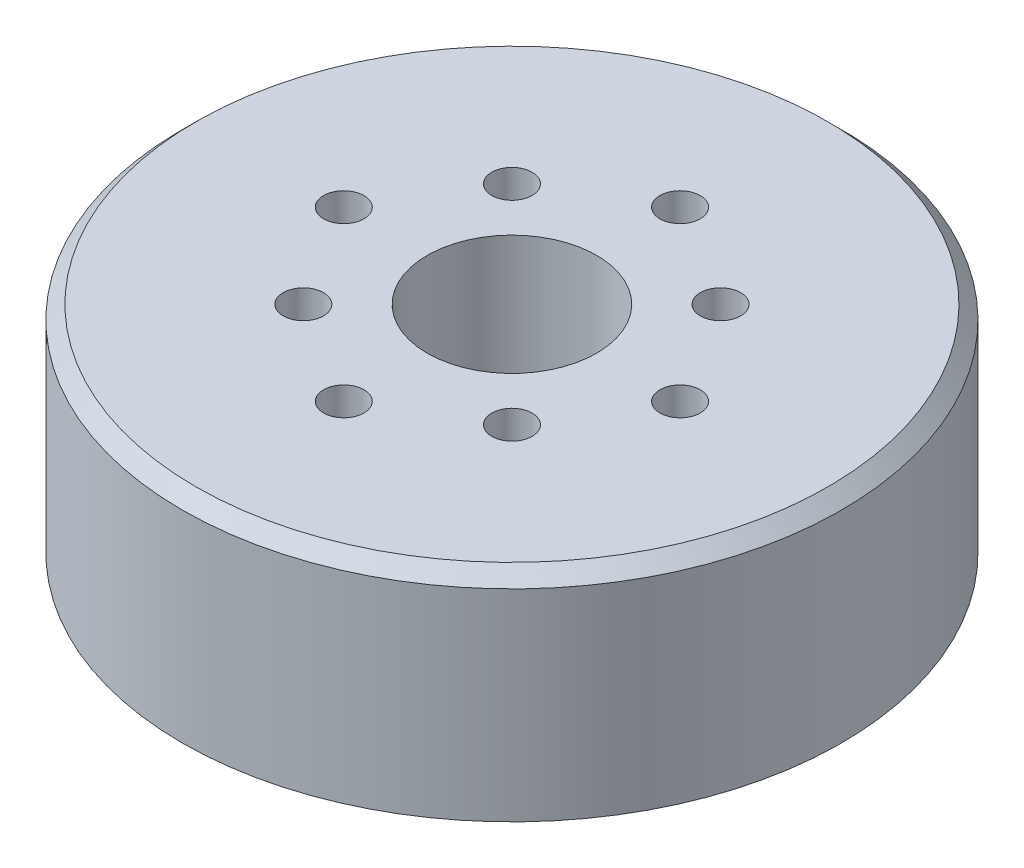
ISO-10303-21;
HEADER;
FILE_DESCRIPTION(('STEP AP214'),'2;1');
FILE_NAME('part.step','',(''),(''),'','','');
FILE_SCHEMA(('AUTOMOTIVE_DESIGN { 1 0 10303 214 1 1 1 1 }'));
ENDSEC;
DATA;
#1=APPLICATION_CONTEXT('core data for automotive mechanical design processes');
#2=APPLICATION_PROTOCOL_DEFINITION('international standard','automotive_design',2000,#1);
#3=PRODUCT_CONTEXT('',#1,'mechanical');
#4=PRODUCT('Part','Part','',(#3));
#5=PRODUCT_RELATED_PRODUCT_CATEGORY('part','',(#4));
#6=PRODUCT_DEFINITION_FORMATION('','',#4);
#7=PRODUCT_DEFINITION_CONTEXT('part definition',#1,'design');
#8=PRODUCT_DEFINITION('design','',#6,#7);
#9=PRODUCT_DEFINITION_SHAPE('','',#8);
#10=(LENGTH_UNIT() NAMED_UNIT(*) SI_UNIT(.MILLI.,.METRE.));
#11=(NAMED_UNIT(*) PLANE_ANGLE_UNIT() SI_UNIT($,.RADIAN.));
#12=(NAMED_UNIT(*) SI_UNIT($,.STERADIAN.) SOLID_ANGLE_UNIT());
#13=UNCERTAINTY_MEASURE_WITH_UNIT(LENGTH_MEASURE(1.E-05),#10,'distance_accuracy_value','');
#14=(GEOMETRIC_REPRESENTATION_CONTEXT(3) GLOBAL_UNCERTAINTY_ASSIGNED_CONTEXT((#13)) GLOBAL_UNIT_ASSIGNED_CONTEXT((#10,
#11,#12)) REPRESENTATION_CONTEXT('',''));
#15=CARTESIAN_POINT('',(0.,0.,0.));
#16=DIRECTION('',(0.,0.,1.));
#17=DIRECTION('',(1.,0.,0.));
#18=AXIS2_PLACEMENT_3D('',#15,#16,#17);
#19=CARTESIAN_POINT('',(0.,16.,0.));
#20=DIRECTION('',(0.,1.,0.));
#21=DIRECTION('',(0.,0.,1.));
#22=AXIS2_PLACEMENT_3D('',#19,#20,#21);
#23=PLANE('',#22);
#24=CARTESIAN_POINT('',(0.,16.,0.));
#25=DIRECTION('',(0.,1.,0.));
#26=DIRECTION('',(0.,0.,1.));
#27=AXIS2_PLACEMENT_3D('',#24,#25,#26);
#28=CIRCLE('',#27,23.5);
#29=CARTESIAN_POINT('',(0.,16.,23.5));
#30=VERTEX_POINT('',#29);
#31=EDGE_CURVE('E42',#30,#30,#28,.T.);
#32=ORIENTED_EDGE('',*,*,#31,.T.);
#33=EDGE_LOOP('',(#32));
#34=FACE_BOUND('',#33,.T.);
#35=CARTESIAN_POINT('',(-7.75301752604241,16.,7.75301752604326));
#36=DIRECTION('',(0.,1.,0.));
#37=DIRECTION('',(0.,0.,1.));
#38=AXIS2_PLACEMENT_3D('',#35,#36,#37);
#39=CIRCLE('',#38,1.50000000000033);
#40=CARTESIAN_POINT('',(-7.75301752604241,16.,9.25301752604358));
#41=VERTEX_POINT('',#40);
#42=EDGE_CURVE('E92',#41,#41,#39,.T.);
#43=ORIENTED_EDGE('',*,*,#42,.F.);
#44=EDGE_LOOP('',(#43));
#45=FACE_BOUND('',#44,.T.);
#46=CARTESIAN_POINT('',(0.,16.,0.));
#47=DIRECTION('',(0.,1.,0.));
#48=DIRECTION('',(0.,0.,1.));
#49=AXIS2_PLACEMENT_3D('',#46,#47,#48);
#50=CIRCLE('',#49,6.3);
#51=CARTESIAN_POINT('',(0.,16.,6.3));
#52=VERTEX_POINT('',#51);
#53=EDGE_CURVE('E80',#52,#52,#50,.T.);
#54=ORIENTED_EDGE('',*,*,#53,.F.);
#55=EDGE_LOOP('',(#54));
#56=FACE_BOUND('',#55,.T.);
#57=CARTESIAN_POINT('',(-12.4999999999996,16.,3.5527136788005E-13));
#58=DIRECTION('',(0.,1.,0.));
#59=DIRECTION('',(0.,0.,1.));
#60=AXIS2_PLACEMENT_3D('',#57,#58,#59);
#61=CIRCLE('',#60,1.50000000000057);
#62=CARTESIAN_POINT('',(-12.4999999999996,16.,1.50000000000092));
#63=VERTEX_POINT('',#62);
#64=EDGE_CURVE('E68',#63,#63,#61,.T.);
#65=ORIENTED_EDGE('',*,*,#64,.F.);
#66=EDGE_LOOP('',(#65));
#67=FACE_BOUND('',#66,.T.);
#68=CARTESIAN_POINT('',(12.5,16.,0.));
#69=DIRECTION('',(0.,1.,0.));
#70=DIRECTION('',(0.,0.,1.));
#71=AXIS2_PLACEMENT_3D('',#68,#69,#70);
#72=CIRCLE('',#71,1.5);
#73=CARTESIAN_POINT('',(12.5,16.,1.50000000000004));
#74=VERTEX_POINT('',#73);
#75=EDGE_CURVE('E56',#74,#74,#72,.T.);
#76=ORIENTED_EDGE('',*,*,#75,.F.);
#77=EDGE_LOOP('',(#76));
#78=FACE_BOUND('',#77,.T.);
#79=CARTESIAN_POINT('',(0.,16.,-12.5));
#80=DIRECTION('',(0.,1.,0.));
#81=DIRECTION('',(0.,0.,1.));
#82=AXIS2_PLACEMENT_3D('',#79,#80,#81);
#83=CIRCLE('',#82,1.5);
#84=CARTESIAN_POINT('',(0.,16.,-11.));
#85=VERTEX_POINT('',#84);
#86=EDGE_CURVE('E50',#85,#85,#83,.T.);
#87=ORIENTED_EDGE('',*,*,#86,.F.);
#88=EDGE_LOOP('',(#87));
#89=FACE_BOUND('',#88,.T.);
#90=CARTESIAN_POINT('',(7.07481118762232E-13,16.,12.5));
#91=DIRECTION('',(0.,1.,0.));
#92=DIRECTION('',(0.,0.,1.));
#93=AXIS2_PLACEMENT_3D('',#90,#91,#92);
#94=CIRCLE('',#93,1.50000000000076);
#95=CARTESIAN_POINT('',(7.07481118762232E-13,16.,14.0000000000008));
#96=VERTEX_POINT('',#95);
#97=EDGE_CURVE('E62',#96,#96,#94,.T.);
#98=ORIENTED_EDGE('',*,*,#97,.F.);
#99=EDGE_LOOP('',(#98));
#100=FACE_BOUND('',#99,.T.);
#101=CARTESIAN_POINT('',(7.75301752604285,16.,-7.75301752604282));
#102=DIRECTION('',(0.,1.,0.));
#103=DIRECTION('',(0.,0.,1.));
#104=AXIS2_PLACEMENT_3D('',#101,#102,#103);
#105=CIRCLE('',#104,1.5);
#106=CARTESIAN_POINT('',(7.75301752604285,16.,-6.25301752604282));
#107=VERTEX_POINT('',#106);
#108=EDGE_CURVE('E74',#107,#107,#105,.T.);
#109=ORIENTED_EDGE('',*,*,#108,.F.);
#110=EDGE_LOOP('',(#109));
#111=FACE_BOUND('',#110,.T.);
#112=CARTESIAN_POINT('',(7.7530175260428,16.,7.75301752604287));
#113=DIRECTION('',(0.,1.,0.));
#114=DIRECTION('',(0.,0.,1.));
#115=AXIS2_PLACEMENT_3D('',#112,#113,#114);
#116=CIRCLE('',#115,1.5);
#117=CARTESIAN_POINT('',(7.7530175260428,16.,9.25301752604288));
#118=VERTEX_POINT('',#117);
#119=EDGE_CURVE('E86',#118,#118,#116,.T.);
#120=ORIENTED_EDGE('',*,*,#119,.F.);
#121=EDGE_LOOP('',(#120));
#122=FACE_BOUND('',#121,.T.);
#123=CARTESIAN_POINT('',(-7.75301752604274,16.,-7.75301752604293));
#124=DIRECTION('',(0.,1.,0.));
#125=DIRECTION('',(0.,0.,1.));
#126=AXIS2_PLACEMENT_3D('',#123,#124,#125);
#127=CIRCLE('',#126,1.5);
#128=CARTESIAN_POINT('',(-7.75301752604274,16.,-6.25301752604293));
#129=VERTEX_POINT('',#128);
#130=EDGE_CURVE('E98',#129,#129,#127,.T.);
#131=ORIENTED_EDGE('',*,*,#130,.F.);
#132=EDGE_LOOP('',(#131));
#133=FACE_BOUND('',#132,.T.);
#134=ADVANCED_FACE('F35',(#34,#45,#56,#67,#78,#89,#100,#111,#122,#133),#23,.T.);
#135=CARTESIAN_POINT('',(0.,0.,0.));
#136=DIRECTION('',(0.,1.,0.));
#137=DIRECTION('',(0.,0.,1.));
#138=AXIS2_PLACEMENT_3D('',#135,#136,#137);
#139=PLANE('',#138);
#140=CARTESIAN_POINT('',(0.,0.,0.));
#141=DIRECTION('',(0.,1.,0.));
#142=DIRECTION('',(0.,0.,1.));
#143=AXIS2_PLACEMENT_3D('',#140,#141,#142);
#144=CIRCLE('',#143,24.5);
#145=CARTESIAN_POINT('',(0.,0.,24.5));
#146=VERTEX_POINT('',#145);
#147=EDGE_CURVE('E46',#146,#146,#144,.T.);
#148=ORIENTED_EDGE('',*,*,#147,.F.);
#149=EDGE_LOOP('',(#148));
#150=FACE_BOUND('',#149,.T.);
#151=CARTESIAN_POINT('',(0.,0.,-12.5));
#152=DIRECTION('',(0.,1.,0.));
#153=DIRECTION('',(0.,0.,1.));
#154=AXIS2_PLACEMENT_3D('',#151,#152,#153);
#155=CIRCLE('',#154,1.5);
#156=CARTESIAN_POINT('',(0.,0.,-11.));
#157=VERTEX_POINT('',#156);
#158=EDGE_CURVE('E53',#157,#157,#155,.T.);
#159=ORIENTED_EDGE('',*,*,#158,.T.);
#160=EDGE_LOOP('',(#159));
#161=FACE_BOUND('',#160,.T.);
#162=CARTESIAN_POINT('',(12.5,0.,0.));
#163=DIRECTION('',(0.,1.,0.));
#164=DIRECTION('',(0.,0.,1.));
#165=AXIS2_PLACEMENT_3D('',#162,#163,#164);
#166=CIRCLE('',#165,1.5);
#167=CARTESIAN_POINT('',(12.5,0.,1.50000000000004));
#168=VERTEX_POINT('',#167);
#169=EDGE_CURVE('E59',#168,#168,#166,.T.);
#170=ORIENTED_EDGE('',*,*,#169,.T.);
#171=EDGE_LOOP('',(#170));
#172=FACE_BOUND('',#171,.T.);
#173=CARTESIAN_POINT('',(7.07481118762232E-13,0.,12.5));
#174=DIRECTION('',(0.,1.,0.));
#175=DIRECTION('',(0.,0.,1.));
#176=AXIS2_PLACEMENT_3D('',#173,#174,#175);
#177=CIRCLE('',#176,1.50000000000076);
#178=CARTESIAN_POINT('',(7.07481118762232E-13,0.,14.0000000000008));
#179=VERTEX_POINT('',#178);
#180=EDGE_CURVE('E65',#179,#179,#177,.T.);
#181=ORIENTED_EDGE('',*,*,#180,.T.);
#182=EDGE_LOOP('',(#181));
#183=FACE_BOUND('',#182,.T.);
#184=CARTESIAN_POINT('',(-12.4999999999996,0.,3.5527136788005E-13));
#185=DIRECTION('',(0.,1.,0.));
#186=DIRECTION('',(0.,0.,1.));
#187=AXIS2_PLACEMENT_3D('',#184,#185,#186);
#188=CIRCLE('',#187,1.50000000000057);
#189=CARTESIAN_POINT('',(-12.4999999999996,0.,1.50000000000092));
#190=VERTEX_POINT('',#189);
#191=EDGE_CURVE('E71',#190,#190,#188,.T.);
#192=ORIENTED_EDGE('',*,*,#191,.T.);
#193=EDGE_LOOP('',(#192));
#194=FACE_BOUND('',#193,.T.);
#195=CARTESIAN_POINT('',(7.75301752604285,0.,-7.75301752604282));
#196=DIRECTION('',(0.,1.,0.));
#197=DIRECTION('',(0.,0.,1.));
#198=AXIS2_PLACEMENT_3D('',#195,#196,#197);
#199=CIRCLE('',#198,1.5);
#200=CARTESIAN_POINT('',(7.75301752604285,0.,-6.25301752604282));
#201=VERTEX_POINT('',#200);
#202=EDGE_CURVE('E77',#201,#201,#199,.T.);
#203=ORIENTED_EDGE('',*,*,#202,.T.);
#204=EDGE_LOOP('',(#203));
#205=FACE_BOUND('',#204,.T.);
#206=CARTESIAN_POINT('',(0.,0.,0.));
#207=DIRECTION('',(0.,1.,0.));
#208=DIRECTION('',(0.,0.,1.));
#209=AXIS2_PLACEMENT_3D('',#206,#207,#208);
#210=CIRCLE('',#209,6.3);
#211=CARTESIAN_POINT('',(0.,0.,6.3));
#212=VERTEX_POINT('',#211);
#213=EDGE_CURVE('E83',#212,#212,#210,.T.);
#214=ORIENTED_EDGE('',*,*,#213,.T.);
#215=EDGE_LOOP('',(#214));
#216=FACE_BOUND('',#215,.T.);
#217=CARTESIAN_POINT('',(7.7530175260428,0.,7.75301752604287));
#218=DIRECTION('',(0.,1.,0.));
#219=DIRECTION('',(0.,0.,1.));
#220=AXIS2_PLACEMENT_3D('',#217,#218,#219);
#221=CIRCLE('',#220,1.5);
#222=CARTESIAN_POINT('',(7.7530175260428,0.,9.25301752604288));
#223=VERTEX_POINT('',#222);
#224=EDGE_CURVE('E89',#223,#223,#221,.T.);
#225=ORIENTED_EDGE('',*,*,#224,.T.);
#226=EDGE_LOOP('',(#225));
#227=FACE_BOUND('',#226,.T.);
#228=CARTESIAN_POINT('',(-7.75301752604241,0.,7.75301752604326));
#229=DIRECTION('',(0.,1.,0.));
#230=DIRECTION('',(0.,0.,1.));
#231=AXIS2_PLACEMENT_3D('',#228,#229,#230);
#232=CIRCLE('',#231,1.50000000000033);
#233=CARTESIAN_POINT('',(-7.75301752604241,0.,9.25301752604358));
#234=VERTEX_POINT('',#233);
#235=EDGE_CURVE('E95',#234,#234,#232,.T.);
#236=ORIENTED_EDGE('',*,*,#235,.T.);
#237=EDGE_LOOP('',(#236));
#238=FACE_BOUND('',#237,.T.);
#239=CARTESIAN_POINT('',(-7.75301752604274,0.,-7.75301752604293));
#240=DIRECTION('',(0.,1.,0.));
#241=DIRECTION('',(0.,0.,1.));
#242=AXIS2_PLACEMENT_3D('',#239,#240,#241);
#243=CIRCLE('',#242,1.5);
#244=CARTESIAN_POINT('',(-7.75301752604274,0.,-6.25301752604293));
#245=VERTEX_POINT('',#244);
#246=EDGE_CURVE('E101',#245,#245,#243,.T.);
#247=ORIENTED_EDGE('',*,*,#246,.T.);
#248=EDGE_LOOP('',(#247));
#249=FACE_BOUND('',#248,.T.);
#250=ADVANCED_FACE('F111',(#150,#161,#172,#183,#194,#205,#216,#227,#238,#249),#139,.F.);
#251=CARTESIAN_POINT('',(0.,16.,0.));
#252=DIRECTION('',(0.,-1.,0.));
#253=DIRECTION('',(0.,0.,-1.));
#254=AXIS2_PLACEMENT_3D('',#251,#252,#253);
#255=CYLINDRICAL_SURFACE('',#254,24.5);
#256=CARTESIAN_POINT('',(0.,15.,0.));
#257=DIRECTION('',(0.,1.,0.));
#258=DIRECTION('',(0.,0.,1.));
#259=AXIS2_PLACEMENT_3D('',#256,#257,#258);
#260=CIRCLE('',#259,24.5);
#261=CARTESIAN_POINT('',(0.,15.,24.5));
#262=VERTEX_POINT('',#261);
#263=EDGE_CURVE('E10',#262,#262,#260,.F.);
#264=ORIENTED_EDGE('',*,*,#263,.T.);
#265=EDGE_LOOP('',(#264));
#266=FACE_BOUND('',#265,.T.);
#267=ORIENTED_EDGE('',*,*,#147,.T.);
#268=EDGE_LOOP('',(#267));
#269=FACE_BOUND('',#268,.T.);
#270=ADVANCED_FACE('F116',(#266,#269),#255,.T.);
#271=CARTESIAN_POINT('',(0.,16.,-12.5));
#272=DIRECTION('',(0.,-1.,0.));
#273=DIRECTION('',(0.,0.,-1.));
#274=AXIS2_PLACEMENT_3D('',#271,#272,#273);
#275=CYLINDRICAL_SURFACE('',#274,1.5);
#276=ORIENTED_EDGE('',*,*,#86,.T.);
#277=EDGE_LOOP('',(#276));
#278=FACE_BOUND('',#277,.T.);
#279=ORIENTED_EDGE('',*,*,#158,.F.);
#280=EDGE_LOOP('',(#279));
#281=FACE_BOUND('',#280,.T.);
#282=ADVANCED_FACE('F121',(#278,#281),#275,.F.);
#283=CARTESIAN_POINT('',(12.5,16.,0.));
#284=DIRECTION('',(0.,-1.,0.));
#285=DIRECTION('',(0.,0.,-1.));
#286=AXIS2_PLACEMENT_3D('',#283,#284,#285);
#287=CYLINDRICAL_SURFACE('',#286,1.5);
#288=ORIENTED_EDGE('',*,*,#75,.T.);
#289=EDGE_LOOP('',(#288));
#290=FACE_BOUND('',#289,.T.);
#291=ORIENTED_EDGE('',*,*,#169,.F.);
#292=EDGE_LOOP('',(#291));
#293=FACE_BOUND('',#292,.T.);
#294=ADVANCED_FACE('F127',(#290,#293),#287,.F.);
#295=CARTESIAN_POINT('',(7.07481118762232E-13,16.,12.5));
#296=DIRECTION('',(0.,-1.,0.));
#297=DIRECTION('',(0.,0.,-1.));
#298=AXIS2_PLACEMENT_3D('',#295,#296,#297);
#299=CYLINDRICAL_SURFACE('',#298,1.50000000000076);
#300=ORIENTED_EDGE('',*,*,#97,.T.);
#301=EDGE_LOOP('',(#300));
#302=FACE_BOUND('',#301,.T.);
#303=ORIENTED_EDGE('',*,*,#180,.F.);
#304=EDGE_LOOP('',(#303));
#305=FACE_BOUND('',#304,.T.);
#306=ADVANCED_FACE('F175',(#302,#305),#299,.F.);
#307=CARTESIAN_POINT('',(-12.4999999999996,16.,3.5527136788005E-13));
#308=DIRECTION('',(0.,-1.,0.));
#309=DIRECTION('',(0.,0.,-1.));
#310=AXIS2_PLACEMENT_3D('',#307,#308,#309);
#311=CYLINDRICAL_SURFACE('',#310,1.50000000000057);
#312=ORIENTED_EDGE('',*,*,#64,.T.);
#313=EDGE_LOOP('',(#312));
#314=FACE_BOUND('',#313,.T.);
#315=ORIENTED_EDGE('',*,*,#191,.F.);
#316=EDGE_LOOP('',(#315));
#317=FACE_BOUND('',#316,.T.);
#318=ADVANCED_FACE('F171',(#314,#317),#311,.F.);
#319=CARTESIAN_POINT('',(7.75301752604285,16.,-7.75301752604282));
#320=DIRECTION('',(0.,-1.,0.));
#321=DIRECTION('',(0.,0.,-1.));
#322=AXIS2_PLACEMENT_3D('',#319,#320,#321);
#323=CYLINDRICAL_SURFACE('',#322,1.5);
#324=ORIENTED_EDGE('',*,*,#108,.T.);
#325=EDGE_LOOP('',(#324));
#326=FACE_BOUND('',#325,.T.);
#327=ORIENTED_EDGE('',*,*,#202,.F.);
#328=EDGE_LOOP('',(#327));
#329=FACE_BOUND('',#328,.T.);
#330=ADVANCED_FACE('F167',(#326,#329),#323,.F.);
#331=CARTESIAN_POINT('',(0.,16.,0.));
#332=DIRECTION('',(0.,-1.,0.));
#333=DIRECTION('',(0.,0.,-1.));
#334=AXIS2_PLACEMENT_3D('',#331,#332,#333);
#335=CYLINDRICAL_SURFACE('',#334,6.3);
#336=ORIENTED_EDGE('',*,*,#53,.T.);
#337=EDGE_LOOP('',(#336));
#338=FACE_BOUND('',#337,.T.);
#339=ORIENTED_EDGE('',*,*,#213,.F.);
#340=EDGE_LOOP('',(#339));
#341=FACE_BOUND('',#340,.T.);
#342=ADVANCED_FACE('F163',(#338,#341),#335,.F.);
#343=CARTESIAN_POINT('',(7.7530175260428,16.,7.75301752604287));
#344=DIRECTION('',(0.,-1.,0.));
#345=DIRECTION('',(0.,0.,-1.));
#346=AXIS2_PLACEMENT_3D('',#343,#344,#345);
#347=CYLINDRICAL_SURFACE('',#346,1.5);
#348=ORIENTED_EDGE('',*,*,#119,.T.);
#349=EDGE_LOOP('',(#348));
#350=FACE_BOUND('',#349,.T.);
#351=ORIENTED_EDGE('',*,*,#224,.F.);
#352=EDGE_LOOP('',(#351));
#353=FACE_BOUND('',#352,.T.);
#354=ADVANCED_FACE('F157',(#350,#353),#347,.F.);
#355=CARTESIAN_POINT('',(-7.75301752604241,16.,7.75301752604326));
#356=DIRECTION('',(0.,-1.,0.));
#357=DIRECTION('',(0.,0.,-1.));
#358=AXIS2_PLACEMENT_3D('',#355,#356,#357);
#359=CYLINDRICAL_SURFACE('',#358,1.50000000000033);
#360=ORIENTED_EDGE('',*,*,#42,.T.);
#361=EDGE_LOOP('',(#360));
#362=FACE_BOUND('',#361,.T.);
#363=ORIENTED_EDGE('',*,*,#235,.F.);
#364=EDGE_LOOP('',(#363));
#365=FACE_BOUND('',#364,.T.);
#366=ADVANCED_FACE('F150',(#362,#365),#359,.F.);
#367=CARTESIAN_POINT('',(-7.75301752604274,16.,-7.75301752604293));
#368=DIRECTION('',(0.,-1.,0.));
#369=DIRECTION('',(0.,0.,-1.));
#370=AXIS2_PLACEMENT_3D('',#367,#368,#369);
#371=CYLINDRICAL_SURFACE('',#370,1.5);
#372=ORIENTED_EDGE('',*,*,#130,.T.);
#373=EDGE_LOOP('',(#372));
#374=FACE_BOUND('',#373,.T.);
#375=ORIENTED_EDGE('',*,*,#246,.F.);
#376=EDGE_LOOP('',(#375));
#377=FACE_BOUND('',#376,.T.);
#378=ADVANCED_FACE('F107',(#374,#377),#371,.F.);
#379=CARTESIAN_POINT('',(0.,16.,0.));
#380=DIRECTION('',(0.,-1.,0.));
#381=DIRECTION('',(0.,0.,-1.));
#382=AXIS2_PLACEMENT_3D('',#379,#380,#381);
#383=CONICAL_SURFACE('',#382,23.5,0.785398163397452);
#384=ORIENTED_EDGE('',*,*,#263,.F.);
#385=EDGE_LOOP('',(#384));
#386=FACE_BOUND('',#385,.T.);
#387=ORIENTED_EDGE('',*,*,#31,.F.);
#388=EDGE_LOOP('',(#387));
#389=FACE_BOUND('',#388,.T.);
#390=ADVANCED_FACE('F37',(#386,#389),#383,.T.);
#391=CLOSED_SHELL('',(#134,#250,#270,#282,#294,#306,#318,#330,#342,#354,#366,#378,#390));
#392=MANIFOLD_SOLID_BREP('B2',#391);
#393=ADVANCED_BREP_SHAPE_REPRESENTATION('',(#18,#392),#14);
#394=SHAPE_DEFINITION_REPRESENTATION(#9,#393);
ENDSEC;
END-ISO-10303-21;
